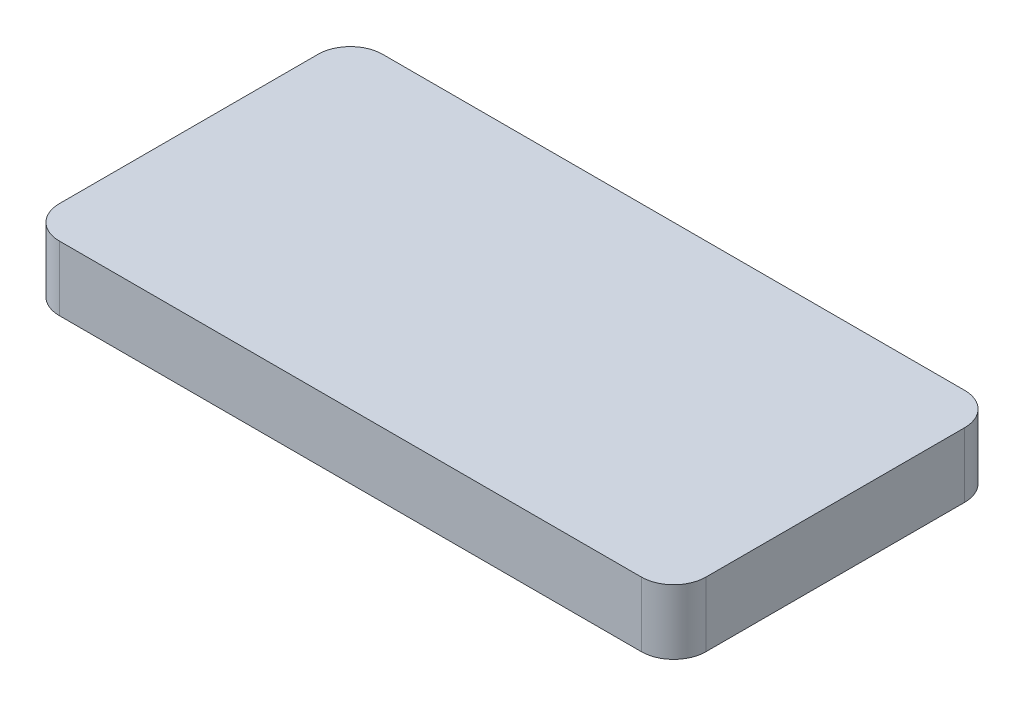
ISO-10303-21;
HEADER;
FILE_DESCRIPTION(('STEP AP214'),'2;1');
FILE_NAME('part.step','',(''),(''),'','','');
FILE_SCHEMA(('AUTOMOTIVE_DESIGN { 1 0 10303 214 1 1 1 1 }'));
ENDSEC;
DATA;
#1=APPLICATION_CONTEXT('core data for automotive mechanical design processes');
#2=APPLICATION_PROTOCOL_DEFINITION('international standard','automotive_design',2000,#1);
#3=PRODUCT_CONTEXT('',#1,'mechanical');
#4=PRODUCT('Part','Part','',(#3));
#5=PRODUCT_RELATED_PRODUCT_CATEGORY('part','',(#4));
#6=PRODUCT_DEFINITION_FORMATION('','',#4);
#7=PRODUCT_DEFINITION_CONTEXT('part definition',#1,'design');
#8=PRODUCT_DEFINITION('design','',#6,#7);
#9=PRODUCT_DEFINITION_SHAPE('','',#8);
#10=(LENGTH_UNIT() NAMED_UNIT(*) SI_UNIT(.MILLI.,.METRE.));
#11=(NAMED_UNIT(*) PLANE_ANGLE_UNIT() SI_UNIT($,.RADIAN.));
#12=(NAMED_UNIT(*) SI_UNIT($,.STERADIAN.) SOLID_ANGLE_UNIT());
#13=UNCERTAINTY_MEASURE_WITH_UNIT(LENGTH_MEASURE(1.E-05),#10,'distance_accuracy_value','');
#14=(GEOMETRIC_REPRESENTATION_CONTEXT(3) GLOBAL_UNCERTAINTY_ASSIGNED_CONTEXT((#13)) GLOBAL_UNIT_ASSIGNED_CONTEXT((#10,
#11,#12)) REPRESENTATION_CONTEXT('',''));
#15=CARTESIAN_POINT('',(0.,0.,0.));
#16=DIRECTION('',(0.,0.,1.));
#17=DIRECTION('',(1.,0.,0.));
#18=AXIS2_PLACEMENT_3D('',#15,#16,#17);
#19=CARTESIAN_POINT('',(-10.6941617369181,4.,-4.98268799712761));
#20=DIRECTION('',(0.,0.,1.));
#21=DIRECTION('',(1.,0.,0.));
#22=AXIS2_PLACEMENT_3D('',#19,#20,#21);
#23=PLANE('',#22);
#24=DIRECTION('',(1.,0.,0.));
#25=VECTOR('',#24,1.);
#26=CARTESIAN_POINT('',(-10.6941617369181,10.,-4.98268799712761));
#27=LINE('',#26,#25);
#28=CARTESIAN_POINT('',(-10.6941617369181,10.,-4.98268799712761));
#29=VERTEX_POINT('',#28);
#30=CARTESIAN_POINT('',(9.23359649239993,10.,-4.98268799712761));
#31=VERTEX_POINT('',#30);
#32=EDGE_CURVE('E107',#29,#31,#27,.T.);
#33=ORIENTED_EDGE('',*,*,#32,.F.);
#34=DIRECTION('',(0.,1.,0.));
#35=VECTOR('',#34,1.);
#36=CARTESIAN_POINT('',(-10.6941617369181,4.,-4.98268799712761));
#37=LINE('',#36,#35);
#38=CARTESIAN_POINT('',(-10.6941617369181,4.,-4.98268799712761));
#39=VERTEX_POINT('',#38);
#40=EDGE_CURVE('E12',#39,#29,#37,.T.);
#41=ORIENTED_EDGE('',*,*,#40,.F.);
#42=DIRECTION('',(1.,0.,0.));
#43=VECTOR('',#42,1.);
#44=CARTESIAN_POINT('',(-10.6941617369181,4.,-4.98268799712761));
#45=LINE('',#44,#43);
#46=CARTESIAN_POINT('',(9.23359649239993,4.,-4.98268799712761));
#47=VERTEX_POINT('',#46);
#48=EDGE_CURVE('E101',#39,#47,#45,.T.);
#49=ORIENTED_EDGE('',*,*,#48,.T.);
#50=DIRECTION('',(0.,1.,0.));
#51=VECTOR('',#50,1.);
#52=CARTESIAN_POINT('',(9.23359649239993,4.,-4.98268799712761));
#53=LINE('',#52,#51);
#54=EDGE_CURVE('E46',#47,#31,#53,.T.);
#55=ORIENTED_EDGE('',*,*,#54,.T.);
#56=EDGE_LOOP('',(#33,#41,#49,#55));
#57=FACE_BOUND('',#56,.T.);
#58=ADVANCED_FACE('F43',(#57),#23,.T.);
#59=CARTESIAN_POINT('',(-10.6941617369181,4.,-21.589153188226));
#60=DIRECTION('',(-1.,0.,0.));
#61=DIRECTION('',(0.,0.,1.));
#62=AXIS2_PLACEMENT_3D('',#59,#60,#61);
#63=PLANE('',#62);
#64=DIRECTION('',(0.,0.,1.));
#65=VECTOR('',#64,1.);
#66=CARTESIAN_POINT('',(-10.6941617369181,10.,-21.589153188226));
#67=LINE('',#66,#65);
#68=CARTESIAN_POINT('',(-10.6941617369181,10.,-21.589153188226));
#69=VERTEX_POINT('',#68);
#70=EDGE_CURVE('E103',#69,#29,#67,.T.);
#71=ORIENTED_EDGE('',*,*,#70,.F.);
#72=DIRECTION('',(0.,1.,0.));
#73=VECTOR('',#72,1.);
#74=CARTESIAN_POINT('',(-10.6941617369181,4.,-21.589153188226));
#75=LINE('',#74,#73);
#76=CARTESIAN_POINT('',(-10.6941617369181,4.,-21.589153188226));
#77=VERTEX_POINT('',#76);
#78=EDGE_CURVE('E52',#77,#69,#75,.T.);
#79=ORIENTED_EDGE('',*,*,#78,.F.);
#80=DIRECTION('',(0.,0.,1.));
#81=VECTOR('',#80,1.);
#82=CARTESIAN_POINT('',(-10.6941617369181,4.,-21.589153188226));
#83=LINE('',#82,#81);
#84=EDGE_CURVE('E91',#77,#39,#83,.T.);
#85=ORIENTED_EDGE('',*,*,#84,.T.);
#86=ORIENTED_EDGE('',*,*,#40,.T.);
#87=EDGE_LOOP('',(#71,#79,#85,#86));
#88=FACE_BOUND('',#87,.T.);
#89=ADVANCED_FACE('F117',(#88),#63,.T.);
#90=CARTESIAN_POINT('',(-10.6941617369181,4.,-21.589153188226));
#91=DIRECTION('',(0.,0.,1.));
#92=DIRECTION('',(1.,0.,0.));
#93=AXIS2_PLACEMENT_3D('',#90,#91,#92);
#94=PLANE('',#93);
#95=DIRECTION('',(1.,0.,0.));
#96=VECTOR('',#95,1.);
#97=CARTESIAN_POINT('',(-10.6941617369181,10.,-21.589153188226));
#98=LINE('',#97,#96);
#99=CARTESIAN_POINT('',(9.23359649239993,10.,-21.589153188226));
#100=VERTEX_POINT('',#99);
#101=EDGE_CURVE('E96',#69,#100,#98,.T.);
#102=ORIENTED_EDGE('',*,*,#101,.T.);
#103=DIRECTION('',(0.,1.,0.));
#104=VECTOR('',#103,1.);
#105=CARTESIAN_POINT('',(9.23359649239993,4.,-21.589153188226));
#106=LINE('',#105,#104);
#107=CARTESIAN_POINT('',(9.23359649239993,4.,-21.589153188226));
#108=VERTEX_POINT('',#107);
#109=EDGE_CURVE('E94',#108,#100,#106,.T.);
#110=ORIENTED_EDGE('',*,*,#109,.F.);
#111=DIRECTION('',(1.,0.,0.));
#112=VECTOR('',#111,1.);
#113=CARTESIAN_POINT('',(-10.6941617369181,4.,-21.589153188226));
#114=LINE('',#113,#112);
#115=EDGE_CURVE('E88',#77,#108,#114,.T.);
#116=ORIENTED_EDGE('',*,*,#115,.F.);
#117=ORIENTED_EDGE('',*,*,#78,.T.);
#118=EDGE_LOOP('',(#102,#110,#116,#117));
#119=FACE_BOUND('',#118,.T.);
#120=ADVANCED_FACE('F95',(#119),#94,.F.);
#121=CARTESIAN_POINT('',(9.23359649239993,4.,-21.589153188226));
#122=DIRECTION('',(-1.,0.,0.));
#123=DIRECTION('',(0.,0.,1.));
#124=AXIS2_PLACEMENT_3D('',#121,#122,#123);
#125=PLANE('',#124);
#126=DIRECTION('',(0.,0.,1.));
#127=VECTOR('',#126,1.);
#128=CARTESIAN_POINT('',(9.23359649239993,10.,-21.589153188226));
#129=LINE('',#128,#127);
#130=EDGE_CURVE('E110',#100,#31,#129,.T.);
#131=ORIENTED_EDGE('',*,*,#130,.T.);
#132=ORIENTED_EDGE('',*,*,#54,.F.);
#133=DIRECTION('',(0.,0.,1.));
#134=VECTOR('',#133,1.);
#135=CARTESIAN_POINT('',(9.23359649239993,4.,-21.589153188226));
#136=LINE('',#135,#134);
#137=EDGE_CURVE('E85',#108,#47,#136,.T.);
#138=ORIENTED_EDGE('',*,*,#137,.F.);
#139=ORIENTED_EDGE('',*,*,#109,.T.);
#140=EDGE_LOOP('',(#131,#132,#138,#139));
#141=FACE_BOUND('',#140,.T.);
#142=ADVANCED_FACE('F100',(#141),#125,.F.);
#143=CARTESIAN_POINT('',(0.,4.,0.));
#144=DIRECTION('',(0.,-1.,0.));
#145=DIRECTION('',(0.,0.,-1.));
#146=AXIS2_PLACEMENT_3D('',#143,#144,#145);
#147=PLANE('',#146);
#148=ORIENTED_EDGE('',*,*,#48,.F.);
#149=ORIENTED_EDGE('',*,*,#84,.F.);
#150=ORIENTED_EDGE('',*,*,#115,.T.);
#151=ORIENTED_EDGE('',*,*,#137,.T.);
#152=EDGE_LOOP('',(#148,#149,#150,#151));
#153=FACE_BOUND('',#152,.T.);
#154=ADVANCED_FACE('F90',(#153),#147,.T.);
#155=CARTESIAN_POINT('',(0.,10.,0.));
#156=DIRECTION('',(0.,-1.,0.));
#157=DIRECTION('',(0.,0.,-1.));
#158=AXIS2_PLACEMENT_3D('',#155,#156,#157);
#159=PLANE('',#158);
#160=ORIENTED_EDGE('',*,*,#32,.T.);
#161=ORIENTED_EDGE('',*,*,#130,.F.);
#162=ORIENTED_EDGE('',*,*,#101,.F.);
#163=ORIENTED_EDGE('',*,*,#70,.T.);
#164=EDGE_LOOP('',(#160,#161,#162,#163));
#165=FACE_BOUND('',#164,.T.);
#166=ADVANCED_FACE('F116',(#165),#159,.F.);
#167=CLOSED_SHELL('',(#58,#89,#120,#142,#154,#166));
#168=MANIFOLD_SOLID_BREP('B2',#167);
#169=CARTESIAN_POINT('',(79.3058382630819,10.,-4.98268799712763));
#170=DIRECTION('',(0.,-1.,0.));
#171=DIRECTION('',(0.,0.,-1.));
#172=AXIS2_PLACEMENT_3D('',#169,#170,#171);
#173=CYLINDRICAL_SURFACE('',#172,5.);
#174=CARTESIAN_POINT('',(79.3058382630819,0.,-4.98268799712763));
#175=DIRECTION('',(0.,1.,0.));
#176=DIRECTION('',(0.,0.,1.));
#177=AXIS2_PLACEMENT_3D('',#174,#175,#176);
#178=CIRCLE('',#177,5.);
#179=CARTESIAN_POINT('',(79.3058382630819,0.,0.0173120028723751));
#180=VERTEX_POINT('',#179);
#181=CARTESIAN_POINT('',(84.3058382630819,0.,-4.98268799712766));
#182=VERTEX_POINT('',#181);
#183=EDGE_CURVE('E263',#180,#182,#178,.T.);
#184=ORIENTED_EDGE('',*,*,#183,.T.);
#185=DIRECTION('',(0.,-1.,0.));
#186=VECTOR('',#185,1.);
#187=CARTESIAN_POINT('',(84.3058382630819,10.,-4.98268799712766));
#188=LINE('',#187,#186);
#189=CARTESIAN_POINT('',(84.3058382630819,10.,-4.98268799712766));
#190=VERTEX_POINT('',#189);
#191=EDGE_CURVE('E41',#190,#182,#188,.T.);
#192=ORIENTED_EDGE('',*,*,#191,.F.);
#193=CARTESIAN_POINT('',(79.3058382630819,10.,-4.98268799712763));
#194=DIRECTION('',(0.,1.,0.));
#195=DIRECTION('',(0.,0.,1.));
#196=AXIS2_PLACEMENT_3D('',#193,#194,#195);
#197=CIRCLE('',#196,5.);
#198=CARTESIAN_POINT('',(79.3058382630819,10.,0.0173120028723751));
#199=VERTEX_POINT('',#198);
#200=EDGE_CURVE('E277',#199,#190,#197,.T.);
#201=ORIENTED_EDGE('',*,*,#200,.F.);
#202=DIRECTION('',(0.,-1.,0.));
#203=VECTOR('',#202,1.);
#204=CARTESIAN_POINT('',(79.3058382630819,10.,0.0173120028723751));
#205=LINE('',#204,#203);
#206=EDGE_CURVE('E259',#199,#180,#205,.T.);
#207=ORIENTED_EDGE('',*,*,#206,.T.);
#208=EDGE_LOOP('',(#184,#192,#201,#207));
#209=FACE_BOUND('',#208,.T.);
#210=ADVANCED_FACE('F167',(#209),#173,.T.);
#211=CARTESIAN_POINT('',(84.3058382630819,10.,-44.9826879971276));
#212=DIRECTION('',(-1.,0.,0.));
#213=DIRECTION('',(0.,0.,1.));
#214=AXIS2_PLACEMENT_3D('',#211,#212,#213);
#215=PLANE('',#214);
#216=DIRECTION('',(0.,0.,-1.));
#217=VECTOR('',#216,1.);
#218=CARTESIAN_POINT('',(84.3058382630819,0.,-44.9826879971276));
#219=LINE('',#218,#217);
#220=CARTESIAN_POINT('',(84.3058382630819,0.,-44.9826879971276));
#221=VERTEX_POINT('',#220);
#222=EDGE_CURVE('E266',#182,#221,#219,.T.);
#223=ORIENTED_EDGE('',*,*,#222,.T.);
#224=DIRECTION('',(0.,-1.,0.));
#225=VECTOR('',#224,1.);
#226=CARTESIAN_POINT('',(84.3058382630819,10.,-44.9826879971276));
#227=LINE('',#226,#225);
#228=CARTESIAN_POINT('',(84.3058382630819,10.,-44.9826879971276));
#229=VERTEX_POINT('',#228);
#230=EDGE_CURVE('E175',#229,#221,#227,.T.);
#231=ORIENTED_EDGE('',*,*,#230,.F.);
#232=DIRECTION('',(0.,0.,-1.));
#233=VECTOR('',#232,1.);
#234=CARTESIAN_POINT('',(84.3058382630819,10.,-44.9826879971276));
#235=LINE('',#234,#233);
#236=EDGE_CURVE('E226',#190,#229,#235,.T.);
#237=ORIENTED_EDGE('',*,*,#236,.F.);
#238=ORIENTED_EDGE('',*,*,#191,.T.);
#239=EDGE_LOOP('',(#223,#231,#237,#238));
#240=FACE_BOUND('',#239,.T.);
#241=ADVANCED_FACE('F312',(#240),#215,.F.);
#242=CARTESIAN_POINT('',(79.3058382630819,10.,-44.9826879971276));
#243=DIRECTION('',(0.,-1.,0.));
#244=DIRECTION('',(0.,0.,-1.));
#245=AXIS2_PLACEMENT_3D('',#242,#243,#244);
#246=CYLINDRICAL_SURFACE('',#245,5.);
#247=CARTESIAN_POINT('',(79.3058382630819,0.,-44.9826879971276));
#248=DIRECTION('',(0.,1.,0.));
#249=DIRECTION('',(0.,0.,1.));
#250=AXIS2_PLACEMENT_3D('',#247,#248,#249);
#251=CIRCLE('',#250,5.);
#252=CARTESIAN_POINT('',(79.3058382630819,0.,-49.9826879971276));
#253=VERTEX_POINT('',#252);
#254=EDGE_CURVE('E268',#221,#253,#251,.T.);
#255=ORIENTED_EDGE('',*,*,#254,.T.);
#256=DIRECTION('',(0.,-1.,0.));
#257=VECTOR('',#256,1.);
#258=CARTESIAN_POINT('',(79.3058382630819,10.,-49.9826879971276));
#259=LINE('',#258,#257);
#260=CARTESIAN_POINT('',(79.3058382630819,10.,-49.9826879971276));
#261=VERTEX_POINT('',#260);
#262=EDGE_CURVE('E284',#261,#253,#259,.T.);
#263=ORIENTED_EDGE('',*,*,#262,.F.);
#264=CARTESIAN_POINT('',(79.3058382630819,10.,-44.9826879971276));
#265=DIRECTION('',(0.,1.,0.));
#266=DIRECTION('',(0.,0.,1.));
#267=AXIS2_PLACEMENT_3D('',#264,#265,#266);
#268=CIRCLE('',#267,5.);
#269=EDGE_CURVE('E292',#229,#261,#268,.T.);
#270=ORIENTED_EDGE('',*,*,#269,.F.);
#271=ORIENTED_EDGE('',*,*,#230,.T.);
#272=EDGE_LOOP('',(#255,#263,#270,#271));
#273=FACE_BOUND('',#272,.T.);
#274=ADVANCED_FACE('F290',(#273),#246,.T.);
#275=CARTESIAN_POINT('',(79.3058382630819,10.,-49.9826879971276));
#276=DIRECTION('',(0.,0.,1.));
#277=DIRECTION('',(1.,0.,0.));
#278=AXIS2_PLACEMENT_3D('',#275,#276,#277);
#279=PLANE('',#278);
#280=DIRECTION('',(-1.,0.,0.));
#281=VECTOR('',#280,1.);
#282=CARTESIAN_POINT('',(79.3058382630819,0.,-49.9826879971276));
#283=LINE('',#282,#281);
#284=CARTESIAN_POINT('',(-10.6941617369181,0.,-49.9826879971276));
#285=VERTEX_POINT('',#284);
#286=EDGE_CURVE('E270',#253,#285,#283,.T.);
#287=ORIENTED_EDGE('',*,*,#286,.T.);
#288=DIRECTION('',(0.,-1.,0.));
#289=VECTOR('',#288,1.);
#290=CARTESIAN_POINT('',(-10.6941617369181,10.,-49.9826879971276));
#291=LINE('',#290,#289);
#292=CARTESIAN_POINT('',(-10.6941617369181,10.,-49.9826879971276));
#293=VERTEX_POINT('',#292);
#294=EDGE_CURVE('E281',#293,#285,#291,.T.);
#295=ORIENTED_EDGE('',*,*,#294,.F.);
#296=DIRECTION('',(-1.,0.,0.));
#297=VECTOR('',#296,1.);
#298=CARTESIAN_POINT('',(79.3058382630819,10.,-49.9826879971276));
#299=LINE('',#298,#297);
#300=EDGE_CURVE('E304',#261,#293,#299,.T.);
#301=ORIENTED_EDGE('',*,*,#300,.F.);
#302=ORIENTED_EDGE('',*,*,#262,.T.);
#303=EDGE_LOOP('',(#287,#295,#301,#302));
#304=FACE_BOUND('',#303,.T.);
#305=ADVANCED_FACE('F300',(#304),#279,.F.);
#306=CARTESIAN_POINT('',(-10.6941617369181,10.,-44.9826879971276));
#307=DIRECTION('',(0.,-1.,0.));
#308=DIRECTION('',(0.,0.,-1.));
#309=AXIS2_PLACEMENT_3D('',#306,#307,#308);
#310=CYLINDRICAL_SURFACE('',#309,5.);
#311=CARTESIAN_POINT('',(-10.6941617369181,0.,-44.9826879971276));
#312=DIRECTION('',(0.,1.,0.));
#313=DIRECTION('',(0.,0.,1.));
#314=AXIS2_PLACEMENT_3D('',#311,#312,#313);
#315=CIRCLE('',#314,5.);
#316=CARTESIAN_POINT('',(-15.6941617369181,0.,-44.9826879971276));
#317=VERTEX_POINT('',#316);
#318=EDGE_CURVE('E272',#285,#317,#315,.T.);
#319=ORIENTED_EDGE('',*,*,#318,.T.);
#320=DIRECTION('',(0.,-1.,0.));
#321=VECTOR('',#320,1.);
#322=CARTESIAN_POINT('',(-15.6941617369181,10.,-44.9826879971276));
#323=LINE('',#322,#321);
#324=CARTESIAN_POINT('',(-15.6941617369181,10.,-44.9826879971276));
#325=VERTEX_POINT('',#324);
#326=EDGE_CURVE('E254',#325,#317,#323,.T.);
#327=ORIENTED_EDGE('',*,*,#326,.F.);
#328=CARTESIAN_POINT('',(-10.6941617369181,10.,-44.9826879971276));
#329=DIRECTION('',(0.,1.,0.));
#330=DIRECTION('',(0.,0.,1.));
#331=AXIS2_PLACEMENT_3D('',#328,#329,#330);
#332=CIRCLE('',#331,5.);
#333=EDGE_CURVE('E245',#293,#325,#332,.T.);
#334=ORIENTED_EDGE('',*,*,#333,.F.);
#335=ORIENTED_EDGE('',*,*,#294,.T.);
#336=EDGE_LOOP('',(#319,#327,#334,#335));
#337=FACE_BOUND('',#336,.T.);
#338=ADVANCED_FACE('F303',(#337),#310,.T.);
#339=CARTESIAN_POINT('',(-15.6941617369181,10.,-44.9826879971276));
#340=DIRECTION('',(1.,0.,0.));
#341=DIRECTION('',(0.,0.,-1.));
#342=AXIS2_PLACEMENT_3D('',#339,#340,#341);
#343=PLANE('',#342);
#344=DIRECTION('',(0.,0.,1.));
#345=VECTOR('',#344,1.);
#346=CARTESIAN_POINT('',(-15.6941617369181,0.,-44.9826879971276));
#347=LINE('',#346,#345);
#348=CARTESIAN_POINT('',(-15.6941617369181,0.,-4.98268799712765));
#349=VERTEX_POINT('',#348);
#350=EDGE_CURVE('E253',#317,#349,#347,.T.);
#351=ORIENTED_EDGE('',*,*,#350,.T.);
#352=DIRECTION('',(0.,-1.,0.));
#353=VECTOR('',#352,1.);
#354=CARTESIAN_POINT('',(-15.6941617369181,10.,-4.98268799712765));
#355=LINE('',#354,#353);
#356=CARTESIAN_POINT('',(-15.6941617369181,10.,-4.98268799712765));
#357=VERTEX_POINT('',#356);
#358=EDGE_CURVE('E250',#357,#349,#355,.T.);
#359=ORIENTED_EDGE('',*,*,#358,.F.);
#360=DIRECTION('',(0.,0.,1.));
#361=VECTOR('',#360,1.);
#362=CARTESIAN_POINT('',(-15.6941617369181,10.,-44.9826879971276));
#363=LINE('',#362,#361);
#364=EDGE_CURVE('E239',#325,#357,#363,.T.);
#365=ORIENTED_EDGE('',*,*,#364,.F.);
#366=ORIENTED_EDGE('',*,*,#326,.T.);
#367=EDGE_LOOP('',(#351,#359,#365,#366));
#368=FACE_BOUND('',#367,.T.);
#369=ADVANCED_FACE('F251',(#368),#343,.F.);
#370=CARTESIAN_POINT('',(-10.6941617369181,10.,-4.98268799712761));
#371=DIRECTION('',(0.,-1.,0.));
#372=DIRECTION('',(0.,0.,-1.));
#373=AXIS2_PLACEMENT_3D('',#370,#371,#372);
#374=CYLINDRICAL_SURFACE('',#373,5.);
#375=CARTESIAN_POINT('',(-10.6941617369181,0.,-4.98268799712761));
#376=DIRECTION('',(0.,1.,0.));
#377=DIRECTION('',(0.,0.,-1.));
#378=AXIS2_PLACEMENT_3D('',#375,#376,#377);
#379=CIRCLE('',#378,5.);
#380=CARTESIAN_POINT('',(-10.6941617369181,0.,0.0173120028723876));
#381=VERTEX_POINT('',#380);
#382=EDGE_CURVE('E212',#349,#381,#379,.T.);
#383=ORIENTED_EDGE('',*,*,#382,.T.);
#384=DIRECTION('',(0.,-1.,0.));
#385=VECTOR('',#384,1.);
#386=CARTESIAN_POINT('',(-10.6941617369181,10.,0.0173120028723876));
#387=LINE('',#386,#385);
#388=CARTESIAN_POINT('',(-10.6941617369181,10.,0.0173120028723876));
#389=VERTEX_POINT('',#388);
#390=EDGE_CURVE('E255',#389,#381,#387,.T.);
#391=ORIENTED_EDGE('',*,*,#390,.F.);
#392=CARTESIAN_POINT('',(-10.6941617369181,10.,-4.98268799712761));
#393=DIRECTION('',(0.,1.,0.));
#394=DIRECTION('',(0.,0.,-1.));
#395=AXIS2_PLACEMENT_3D('',#392,#393,#394);
#396=CIRCLE('',#395,5.);
#397=EDGE_CURVE('E243',#357,#389,#396,.T.);
#398=ORIENTED_EDGE('',*,*,#397,.F.);
#399=ORIENTED_EDGE('',*,*,#358,.T.);
#400=EDGE_LOOP('',(#383,#391,#398,#399));
#401=FACE_BOUND('',#400,.T.);
#402=ADVANCED_FACE('F257',(#401),#374,.T.);
#403=CARTESIAN_POINT('',(79.3058382630819,10.,0.0173120028723751));
#404=DIRECTION('',(0.,0.,-1.));
#405=DIRECTION('',(-1.,0.,0.));
#406=AXIS2_PLACEMENT_3D('',#403,#404,#405);
#407=PLANE('',#406);
#408=DIRECTION('',(1.,0.,0.));
#409=VECTOR('',#408,1.);
#410=CARTESIAN_POINT('',(79.3058382630819,0.,0.0173120028723751));
#411=LINE('',#410,#409);
#412=EDGE_CURVE('E218',#381,#180,#411,.T.);
#413=ORIENTED_EDGE('',*,*,#412,.T.);
#414=ORIENTED_EDGE('',*,*,#206,.F.);
#415=DIRECTION('',(1.,0.,0.));
#416=VECTOR('',#415,1.);
#417=CARTESIAN_POINT('',(79.3058382630819,10.,0.0173120028723751));
#418=LINE('',#417,#416);
#419=EDGE_CURVE('E183',#389,#199,#418,.T.);
#420=ORIENTED_EDGE('',*,*,#419,.F.);
#421=ORIENTED_EDGE('',*,*,#390,.T.);
#422=EDGE_LOOP('',(#413,#414,#420,#421));
#423=FACE_BOUND('',#422,.T.);
#424=ADVANCED_FACE('F328',(#423),#407,.F.);
#425=CARTESIAN_POINT('',(79.3058382630819,10.,-4.98268799712763));
#426=DIRECTION('',(0.,1.,0.));
#427=DIRECTION('',(0.,0.,1.));
#428=AXIS2_PLACEMENT_3D('',#425,#426,#427);
#429=PLANE('',#428);
#430=ORIENTED_EDGE('',*,*,#200,.T.);
#431=ORIENTED_EDGE('',*,*,#236,.T.);
#432=ORIENTED_EDGE('',*,*,#269,.T.);
#433=ORIENTED_EDGE('',*,*,#300,.T.);
#434=ORIENTED_EDGE('',*,*,#333,.T.);
#435=ORIENTED_EDGE('',*,*,#364,.T.);
#436=ORIENTED_EDGE('',*,*,#397,.T.);
#437=ORIENTED_EDGE('',*,*,#419,.T.);
#438=EDGE_LOOP('',(#430,#431,#432,#433,#434,#435,#436,#437));
#439=FACE_BOUND('',#438,.T.);
#440=ADVANCED_FACE('F241',(#439),#429,.T.);
#441=CARTESIAN_POINT('',(79.3058382630819,0.,-4.98268799712763));
#442=DIRECTION('',(0.,1.,0.));
#443=DIRECTION('',(0.,0.,1.));
#444=AXIS2_PLACEMENT_3D('',#441,#442,#443);
#445=PLANE('',#444);
#446=ORIENTED_EDGE('',*,*,#183,.F.);
#447=ORIENTED_EDGE('',*,*,#412,.F.);
#448=ORIENTED_EDGE('',*,*,#382,.F.);
#449=ORIENTED_EDGE('',*,*,#350,.F.);
#450=ORIENTED_EDGE('',*,*,#318,.F.);
#451=ORIENTED_EDGE('',*,*,#286,.F.);
#452=ORIENTED_EDGE('',*,*,#254,.F.);
#453=ORIENTED_EDGE('',*,*,#222,.F.);
#454=EDGE_LOOP('',(#446,#447,#448,#449,#450,#451,#452,#453));
#455=FACE_BOUND('',#454,.T.);
#456=ADVANCED_FACE('F296',(#455),#445,.F.);
#457=CLOSED_SHELL('',(#210,#241,#274,#305,#338,#369,#402,#424,#440,#456));
#458=MANIFOLD_SOLID_BREP('B6',#457);
#459=ADVANCED_BREP_SHAPE_REPRESENTATION('',(#18,#168,#458),#14);
#460=SHAPE_DEFINITION_REPRESENTATION(#9,#459);
ENDSEC;
END-ISO-10303-21;
